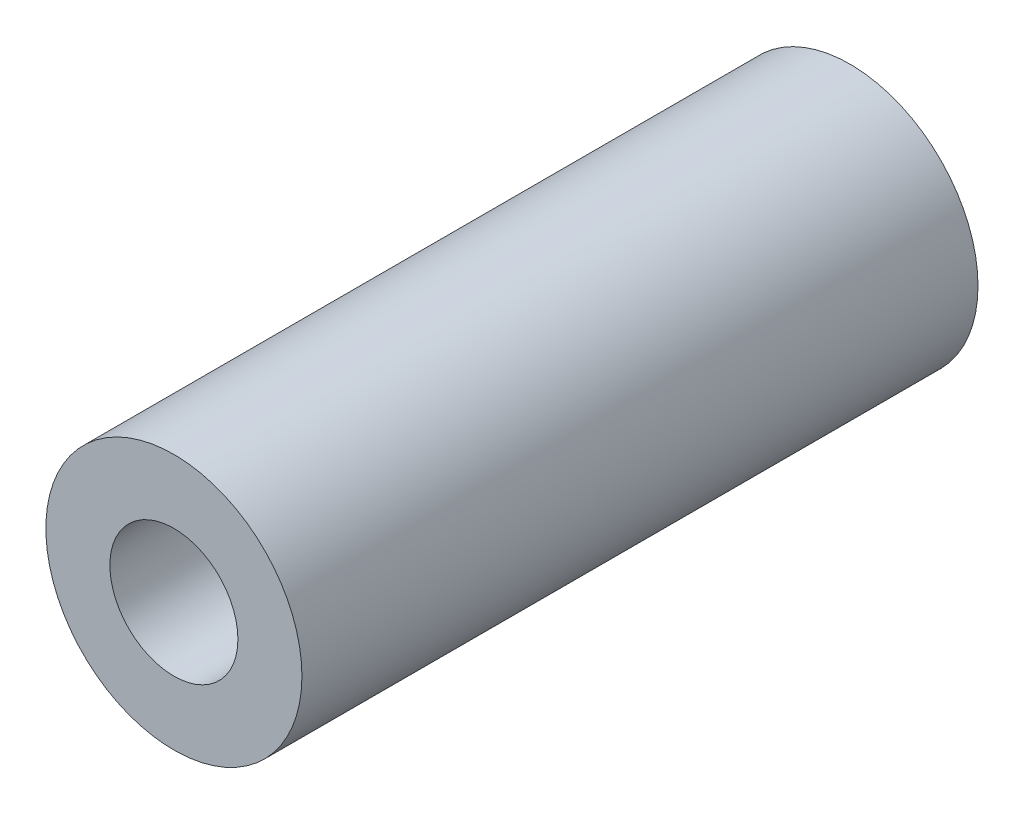
ISO-10303-21;
HEADER;
FILE_DESCRIPTION(('STEP AP214'),'2;1');
FILE_NAME('part.step','',(''),(''),'','','');
FILE_SCHEMA(('AUTOMOTIVE_DESIGN { 1 0 10303 214 1 1 1 1 }'));
ENDSEC;
DATA;
#1=APPLICATION_CONTEXT('core data for automotive mechanical design processes');
#2=APPLICATION_PROTOCOL_DEFINITION('international standard','automotive_design',2000,#1);
#3=PRODUCT_CONTEXT('',#1,'mechanical');
#4=PRODUCT('Part','Part','',(#3));
#5=PRODUCT_RELATED_PRODUCT_CATEGORY('part','',(#4));
#6=PRODUCT_DEFINITION_FORMATION('','',#4);
#7=PRODUCT_DEFINITION_CONTEXT('part definition',#1,'design');
#8=PRODUCT_DEFINITION('design','',#6,#7);
#9=PRODUCT_DEFINITION_SHAPE('','',#8);
#10=(LENGTH_UNIT() NAMED_UNIT(*) SI_UNIT(.MILLI.,.METRE.));
#11=(NAMED_UNIT(*) PLANE_ANGLE_UNIT() SI_UNIT($,.RADIAN.));
#12=(NAMED_UNIT(*) SI_UNIT($,.STERADIAN.) SOLID_ANGLE_UNIT());
#13=UNCERTAINTY_MEASURE_WITH_UNIT(LENGTH_MEASURE(1.E-05),#10,'distance_accuracy_value','');
#14=(GEOMETRIC_REPRESENTATION_CONTEXT(3) GLOBAL_UNCERTAINTY_ASSIGNED_CONTEXT((#13)) GLOBAL_UNIT_ASSIGNED_CONTEXT((#10,
#11,#12)) REPRESENTATION_CONTEXT('',''));
#15=CARTESIAN_POINT('',(0.,0.,0.));
#16=DIRECTION('',(0.,0.,1.));
#17=DIRECTION('',(1.,0.,0.));
#18=AXIS2_PLACEMENT_3D('',#15,#16,#17);
#19=CARTESIAN_POINT('',(0.,0.,26.4));
#20=DIRECTION('',(0.,0.,-1.));
#21=DIRECTION('',(-1.,0.,0.));
#22=AXIS2_PLACEMENT_3D('',#19,#20,#21);
#23=CYLINDRICAL_SURFACE('',#22,5.);
#24=CARTESIAN_POINT('',(0.,0.,26.4));
#25=DIRECTION('',(0.,0.,1.));
#26=DIRECTION('',(1.,0.,0.));
#27=AXIS2_PLACEMENT_3D('',#24,#25,#26);
#28=CIRCLE('',#27,5.);
#29=CARTESIAN_POINT('',(5.,0.,26.4));
#30=VERTEX_POINT('',#29);
#31=EDGE_CURVE('E10',#30,#30,#28,.T.);
#32=ORIENTED_EDGE('',*,*,#31,.F.);
#33=EDGE_LOOP('',(#32));
#34=FACE_BOUND('',#33,.T.);
#35=CARTESIAN_POINT('',(0.,0.,0.));
#36=DIRECTION('',(0.,0.,1.));
#37=DIRECTION('',(1.,0.,0.));
#38=AXIS2_PLACEMENT_3D('',#35,#36,#37);
#39=CIRCLE('',#38,5.);
#40=CARTESIAN_POINT('',(5.,0.,0.));
#41=VERTEX_POINT('',#40);
#42=EDGE_CURVE('E38',#41,#41,#39,.T.);
#43=ORIENTED_EDGE('',*,*,#42,.T.);
#44=EDGE_LOOP('',(#43));
#45=FACE_BOUND('',#44,.T.);
#46=ADVANCED_FACE('F35',(#34,#45),#23,.T.);
#47=CARTESIAN_POINT('',(0.,0.,26.4));
#48=DIRECTION('',(0.,0.,1.));
#49=DIRECTION('',(1.,0.,0.));
#50=AXIS2_PLACEMENT_3D('',#47,#48,#49);
#51=PLANE('',#50);
#52=CARTESIAN_POINT('',(0.,0.,26.4));
#53=DIRECTION('',(0.,0.,1.));
#54=DIRECTION('',(1.,0.,0.));
#55=AXIS2_PLACEMENT_3D('',#52,#53,#54);
#56=CIRCLE('',#55,2.5);
#57=CARTESIAN_POINT('',(2.5,0.,26.4));
#58=VERTEX_POINT('',#57);
#59=EDGE_CURVE('E49',#58,#58,#56,.T.);
#60=ORIENTED_EDGE('',*,*,#59,.F.);
#61=EDGE_LOOP('',(#60));
#62=FACE_BOUND('',#61,.T.);
#63=ORIENTED_EDGE('',*,*,#31,.T.);
#64=EDGE_LOOP('',(#63));
#65=FACE_BOUND('',#64,.T.);
#66=ADVANCED_FACE('F55',(#62,#65),#51,.T.);
#67=CARTESIAN_POINT('',(0.,0.,0.));
#68=DIRECTION('',(0.,0.,1.));
#69=DIRECTION('',(1.,0.,0.));
#70=AXIS2_PLACEMENT_3D('',#67,#68,#69);
#71=PLANE('',#70);
#72=CARTESIAN_POINT('',(0.,0.,0.));
#73=DIRECTION('',(0.,0.,1.));
#74=DIRECTION('',(1.,0.,0.));
#75=AXIS2_PLACEMENT_3D('',#72,#73,#74);
#76=CIRCLE('',#75,2.5);
#77=CARTESIAN_POINT('',(2.5,0.,0.));
#78=VERTEX_POINT('',#77);
#79=EDGE_CURVE('E45',#78,#78,#76,.T.);
#80=ORIENTED_EDGE('',*,*,#79,.T.);
#81=EDGE_LOOP('',(#80));
#82=FACE_BOUND('',#81,.T.);
#83=ORIENTED_EDGE('',*,*,#42,.F.);
#84=EDGE_LOOP('',(#83));
#85=FACE_BOUND('',#84,.T.);
#86=ADVANCED_FACE('F57',(#82,#85),#71,.F.);
#87=CARTESIAN_POINT('',(0.,0.,26.4));
#88=DIRECTION('',(0.,0.,1.));
#89=DIRECTION('',(1.,0.,0.));
#90=AXIS2_PLACEMENT_3D('',#87,#88,#89);
#91=CYLINDRICAL_SURFACE('',#90,2.5);
#92=ORIENTED_EDGE('',*,*,#79,.F.);
#93=EDGE_LOOP('',(#92));
#94=FACE_BOUND('',#93,.T.);
#95=ORIENTED_EDGE('',*,*,#59,.T.);
#96=EDGE_LOOP('',(#95));
#97=FACE_BOUND('',#96,.T.);
#98=ADVANCED_FACE('F53',(#94,#97),#91,.F.);
#99=CLOSED_SHELL('',(#46,#66,#86,#98));
#100=MANIFOLD_SOLID_BREP('B2',#99);
#101=ADVANCED_BREP_SHAPE_REPRESENTATION('',(#18,#100),#14);
#102=SHAPE_DEFINITION_REPRESENTATION(#9,#101);
ENDSEC;
END-ISO-10303-21;
